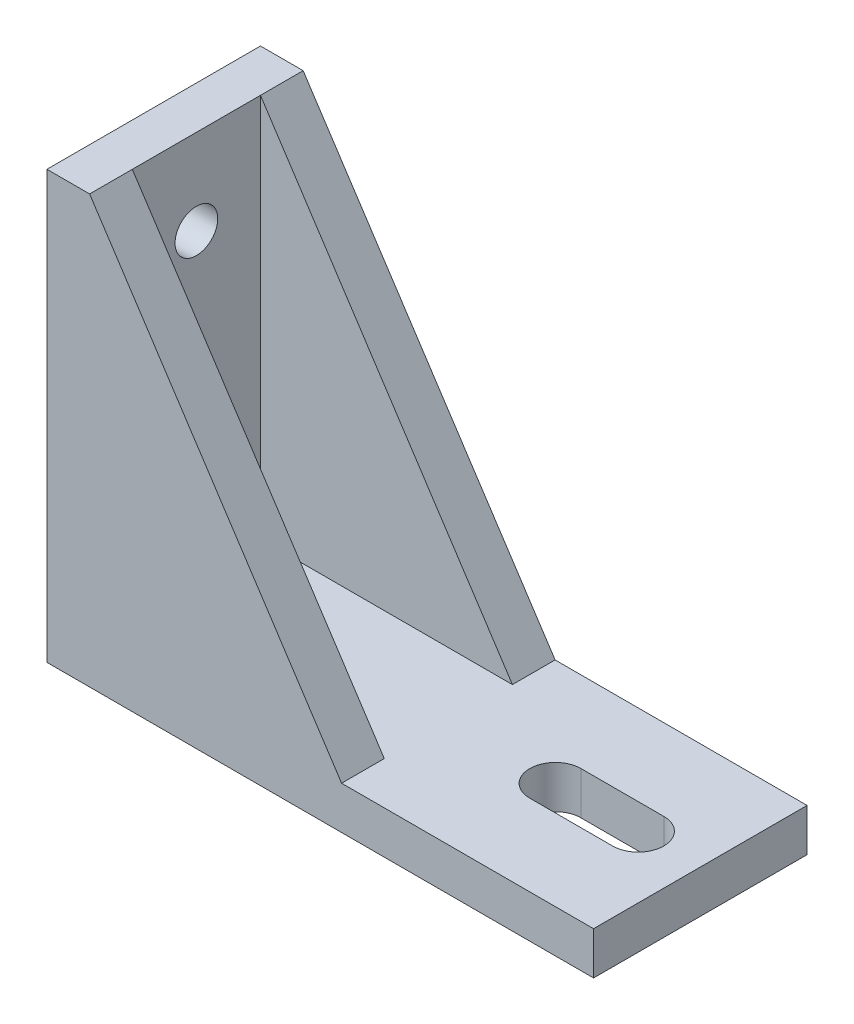
ISO-10303-21;
HEADER;
FILE_DESCRIPTION(('STEP AP214'),'2;1');
FILE_NAME('part.step','',(''),(''),'','','');
FILE_SCHEMA(('AUTOMOTIVE_DESIGN { 1 0 10303 214 1 1 1 1 }'));
ENDSEC;
DATA;
#1=APPLICATION_CONTEXT('core data for automotive mechanical design processes');
#2=APPLICATION_PROTOCOL_DEFINITION('international standard','automotive_design',2000,#1);
#3=PRODUCT_CONTEXT('',#1,'mechanical');
#4=PRODUCT('Part','Part','',(#3));
#5=PRODUCT_RELATED_PRODUCT_CATEGORY('part','',(#4));
#6=PRODUCT_DEFINITION_FORMATION('','',#4);
#7=PRODUCT_DEFINITION_CONTEXT('part definition',#1,'design');
#8=PRODUCT_DEFINITION('design','',#6,#7);
#9=PRODUCT_DEFINITION_SHAPE('','',#8);
#10=(LENGTH_UNIT() NAMED_UNIT(*) SI_UNIT(.MILLI.,.METRE.));
#11=(NAMED_UNIT(*) PLANE_ANGLE_UNIT() SI_UNIT($,.RADIAN.));
#12=(NAMED_UNIT(*) SI_UNIT($,.STERADIAN.) SOLID_ANGLE_UNIT());
#13=UNCERTAINTY_MEASURE_WITH_UNIT(LENGTH_MEASURE(1.E-05),#10,'distance_accuracy_value','');
#14=(GEOMETRIC_REPRESENTATION_CONTEXT(3) GLOBAL_UNCERTAINTY_ASSIGNED_CONTEXT((#13)) GLOBAL_UNIT_ASSIGNED_CONTEXT((#10,
#11,#12)) REPRESENTATION_CONTEXT('',''));
#15=CARTESIAN_POINT('',(0.,0.,0.));
#16=DIRECTION('',(0.,0.,1.));
#17=DIRECTION('',(1.,0.,0.));
#18=AXIS2_PLACEMENT_3D('',#15,#16,#17);
#19=CARTESIAN_POINT('',(-30.1722165221151,5.,-4.04636382411759));
#20=DIRECTION('',(1.,0.,0.));
#21=DIRECTION('',(0.,0.,-1.));
#22=AXIS2_PLACEMENT_3D('',#19,#20,#21);
#23=PLANE('',#22);
#24=CARTESIAN_POINT('',(-30.1722165221151,15.,3.4536361758824));
#25=DIRECTION('',(-1.,0.,0.));
#26=DIRECTION('',(0.,0.,1.));
#27=AXIS2_PLACEMENT_3D('',#24,#25,#26);
#28=CIRCLE('',#27,2.5);
#29=CARTESIAN_POINT('',(-30.1722165221151,15.,5.9536361758824));
#30=VERTEX_POINT('',#29);
#31=EDGE_CURVE('E303',#30,#30,#28,.T.);
#32=ORIENTED_EDGE('',*,*,#31,.F.);
#33=EDGE_LOOP('',(#32));
#34=FACE_BOUND('',#33,.T.);
#35=CARTESIAN_POINT('',(-30.1722165221151,40.,3.4536361758824));
#36=DIRECTION('',(-1.,0.,0.));
#37=DIRECTION('',(0.,0.,1.));
#38=AXIS2_PLACEMENT_3D('',#35,#36,#37);
#39=CIRCLE('',#38,2.5);
#40=CARTESIAN_POINT('',(-30.1722165221151,40.,5.95363617588241));
#41=VERTEX_POINT('',#40);
#42=EDGE_CURVE('E311',#41,#41,#39,.T.);
#43=ORIENTED_EDGE('',*,*,#42,.F.);
#44=EDGE_LOOP('',(#43));
#45=FACE_BOUND('',#44,.T.);
#46=DIRECTION('',(0.,0.,1.));
#47=VECTOR('',#46,1.);
#48=CARTESIAN_POINT('',(-30.1722165221151,0.,-4.04636382411759));
#49=LINE('',#48,#47);
#50=CARTESIAN_POINT('',(-30.1722165221151,0.,-9.04636382411759));
#51=VERTEX_POINT('',#50);
#52=CARTESIAN_POINT('',(-30.1722165221151,0.,15.9536361758824));
#53=VERTEX_POINT('',#52);
#54=EDGE_CURVE('E337',#51,#53,#49,.T.);
#55=ORIENTED_EDGE('',*,*,#54,.T.);
#56=DIRECTION('',(0.,-1.,0.));
#57=VECTOR('',#56,1.);
#58=CARTESIAN_POINT('',(-30.1722165221151,0.,15.9536361758824));
#59=LINE('',#58,#57);
#60=CARTESIAN_POINT('',(-30.1722165221151,50.,15.9536361758824));
#61=VERTEX_POINT('',#60);
#62=EDGE_CURVE('E253',#61,#53,#59,.T.);
#63=ORIENTED_EDGE('',*,*,#62,.F.);
#64=DIRECTION('',(0.,0.,1.));
#65=VECTOR('',#64,1.);
#66=CARTESIAN_POINT('',(-30.1722165221151,50.,-4.04636382411759));
#67=LINE('',#66,#65);
#68=CARTESIAN_POINT('',(-30.1722165221151,50.,-9.04636382411759));
#69=VERTEX_POINT('',#68);
#70=EDGE_CURVE('E320',#69,#61,#67,.T.);
#71=ORIENTED_EDGE('',*,*,#70,.F.);
#72=DIRECTION('',(0.,1.,0.));
#73=VECTOR('',#72,1.);
#74=CARTESIAN_POINT('',(-30.1722165221151,50.,-9.04636382411759));
#75=LINE('',#74,#73);
#76=EDGE_CURVE('E400',#51,#69,#75,.T.);
#77=ORIENTED_EDGE('',*,*,#76,.F.);
#78=EDGE_LOOP('',(#55,#63,#71,#77));
#79=FACE_BOUND('',#78,.T.);
#80=ADVANCED_FACE('F113',(#34,#45,#79),#23,.F.);
#81=CARTESIAN_POINT('',(33.8277834778849,5.,-4.04636382411759));
#82=DIRECTION('',(-1.,0.,0.));
#83=DIRECTION('',(0.,0.,1.));
#84=AXIS2_PLACEMENT_3D('',#81,#82,#83);
#85=PLANE('',#84);
#86=DIRECTION('',(0.,0.,-1.));
#87=VECTOR('',#86,1.);
#88=CARTESIAN_POINT('',(33.8277834778849,0.,-4.04636382411759));
#89=LINE('',#88,#87);
#90=CARTESIAN_POINT('',(33.8277834778849,0.,15.9536361758824));
#91=VERTEX_POINT('',#90);
#92=CARTESIAN_POINT('',(33.8277834778849,0.,-9.04636382411759));
#93=VERTEX_POINT('',#92);
#94=EDGE_CURVE('E342',#91,#93,#89,.T.);
#95=ORIENTED_EDGE('',*,*,#94,.T.);
#96=DIRECTION('',(0.,-1.,0.));
#97=VECTOR('',#96,1.);
#98=CARTESIAN_POINT('',(33.8277834778849,0.,-9.04636382411759));
#99=LINE('',#98,#97);
#100=CARTESIAN_POINT('',(33.8277834778849,5.,-9.04636382411759));
#101=VERTEX_POINT('',#100);
#102=EDGE_CURVE('E223',#101,#93,#99,.T.);
#103=ORIENTED_EDGE('',*,*,#102,.F.);
#104=DIRECTION('',(0.,0.,-1.));
#105=VECTOR('',#104,1.);
#106=CARTESIAN_POINT('',(33.8277834778849,5.,-4.04636382411759));
#107=LINE('',#106,#105);
#108=CARTESIAN_POINT('',(33.8277834778849,5.,15.9536361758824));
#109=VERTEX_POINT('',#108);
#110=EDGE_CURVE('E218',#109,#101,#107,.T.);
#111=ORIENTED_EDGE('',*,*,#110,.F.);
#112=DIRECTION('',(0.,1.,0.));
#113=VECTOR('',#112,1.);
#114=CARTESIAN_POINT('',(33.8277834778849,5.,15.9536361758824));
#115=LINE('',#114,#113);
#116=EDGE_CURVE('E261',#91,#109,#115,.T.);
#117=ORIENTED_EDGE('',*,*,#116,.F.);
#118=EDGE_LOOP('',(#95,#103,#111,#117));
#119=FACE_BOUND('',#118,.T.);
#120=ADVANCED_FACE('F388',(#119),#85,.F.);
#121=CARTESIAN_POINT('',(0.,5.,0.));
#122=DIRECTION('',(0.,1.,0.));
#123=DIRECTION('',(0.,0.,1.));
#124=AXIS2_PLACEMENT_3D('',#121,#122,#123);
#125=PLANE('',#124);
#126=CARTESIAN_POINT('',(26.5542372270442,5.,3.45370519441454));
#127=DIRECTION('',(0.,1.,0.));
#128=DIRECTION('',(0.,0.,1.));
#129=AXIS2_PLACEMENT_3D('',#126,#127,#128);
#130=CIRCLE('',#129,3.);
#131=CARTESIAN_POINT('',(26.55422092342,5.,6.45370519437026));
#132=VERTEX_POINT('',#131);
#133=CARTESIAN_POINT('',(26.5542535306684,5.,0.453705194458847));
#134=VERTEX_POINT('',#133);
#135=EDGE_CURVE('E128',#132,#134,#130,.T.);
#136=ORIENTED_EDGE('',*,*,#135,.F.);
#137=DIRECTION('',(0.999999999985233,0.,5.43454140294714E-06));
#138=VECTOR('',#137,1.);
#139=CARTESIAN_POINT('',(16.8542209235632,5.,6.45365247931865));
#140=LINE('',#139,#138);
#141=CARTESIAN_POINT('',(16.8542209235632,5.,6.45365247931863));
#142=VERTEX_POINT('',#141);
#143=EDGE_CURVE('E278',#142,#132,#140,.T.);
#144=ORIENTED_EDGE('',*,*,#143,.F.);
#145=CARTESIAN_POINT('',(16.8542372271874,5.,3.45365247936294));
#146=DIRECTION('',(0.,1.,0.));
#147=DIRECTION('',(0.,0.,1.));
#148=AXIS2_PLACEMENT_3D('',#145,#146,#147);
#149=CIRCLE('',#148,3.);
#150=CARTESIAN_POINT('',(16.8542535308116,5.,0.453652479407238));
#151=VERTEX_POINT('',#150);
#152=EDGE_CURVE('E285',#151,#142,#149,.T.);
#153=ORIENTED_EDGE('',*,*,#152,.F.);
#154=DIRECTION('',(0.999999999985233,0.,5.43454140294714E-06));
#155=VECTOR('',#154,1.);
#156=CARTESIAN_POINT('',(16.8542535308116,5.,0.453652479407238));
#157=LINE('',#156,#155);
#158=EDGE_CURVE('E281',#151,#134,#157,.T.);
#159=ORIENTED_EDGE('',*,*,#158,.T.);
#160=EDGE_LOOP('',(#136,#144,#153,#159));
#161=FACE_BOUND('',#160,.T.);
#162=DIRECTION('',(0.,0.,-1.));
#163=VECTOR('',#162,1.);
#164=CARTESIAN_POINT('',(-25.1722165221151,5.,-4.04636382411759));
#165=LINE('',#164,#163);
#166=CARTESIAN_POINT('',(-25.1722165221151,5.,10.9536361758824));
#167=VERTEX_POINT('',#166);
#168=CARTESIAN_POINT('',(-25.1722165221151,5.,-4.04636382411759));
#169=VERTEX_POINT('',#168);
#170=EDGE_CURVE('E319',#167,#169,#165,.T.);
#171=ORIENTED_EDGE('',*,*,#170,.F.);
#172=DIRECTION('',(1.,0.,0.));
#173=VECTOR('',#172,1.);
#174=CARTESIAN_POINT('',(-30.1722165221151,5.,10.9536361758824));
#175=LINE('',#174,#173);
#176=CARTESIAN_POINT('',(4.32778347788492,5.,10.9536361758824));
#177=VERTEX_POINT('',#176);
#178=EDGE_CURVE('E338',#167,#177,#175,.T.);
#179=ORIENTED_EDGE('',*,*,#178,.T.);
#180=DIRECTION('',(0.,0.,-1.));
#181=VECTOR('',#180,1.);
#182=CARTESIAN_POINT('',(4.32778347788492,5.,15.9536361758824));
#183=LINE('',#182,#181);
#184=CARTESIAN_POINT('',(4.32778347788492,5.,15.9536361758824));
#185=VERTEX_POINT('',#184);
#186=EDGE_CURVE('E275',#185,#177,#183,.T.);
#187=ORIENTED_EDGE('',*,*,#186,.F.);
#188=DIRECTION('',(-1.,0.,0.));
#189=VECTOR('',#188,1.);
#190=CARTESIAN_POINT('',(4.32778347788492,5.,15.9536361758824));
#191=LINE('',#190,#189);
#192=EDGE_CURVE('E265',#109,#185,#191,.T.);
#193=ORIENTED_EDGE('',*,*,#192,.F.);
#194=ORIENTED_EDGE('',*,*,#110,.T.);
#195=DIRECTION('',(1.,0.,0.));
#196=VECTOR('',#195,1.);
#197=CARTESIAN_POINT('',(33.8277834778849,5.,-9.04636382411759));
#198=LINE('',#197,#196);
#199=CARTESIAN_POINT('',(4.32778347788492,5.,-9.04636382411759));
#200=VERTEX_POINT('',#199);
#201=EDGE_CURVE('E209',#200,#101,#198,.T.);
#202=ORIENTED_EDGE('',*,*,#201,.F.);
#203=DIRECTION('',(0.,0.,1.));
#204=VECTOR('',#203,1.);
#205=CARTESIAN_POINT('',(4.32778347788492,5.,-9.04636382411759));
#206=LINE('',#205,#204);
#207=CARTESIAN_POINT('',(4.32778347788492,5.,-4.04636382411759));
#208=VERTEX_POINT('',#207);
#209=EDGE_CURVE('E215',#200,#208,#206,.T.);
#210=ORIENTED_EDGE('',*,*,#209,.T.);
#211=DIRECTION('',(-1.,0.,0.));
#212=VECTOR('',#211,1.);
#213=CARTESIAN_POINT('',(-30.1722165221151,5.,-4.04636382411759));
#214=LINE('',#213,#212);
#215=EDGE_CURVE('E345',#208,#169,#214,.T.);
#216=ORIENTED_EDGE('',*,*,#215,.T.);
#217=EDGE_LOOP('',(#171,#179,#187,#193,#194,#202,#210,#216));
#218=FACE_BOUND('',#217,.T.);
#219=ADVANCED_FACE('F212',(#161,#218),#125,.T.);
#220=CARTESIAN_POINT('',(0.,0.,0.));
#221=DIRECTION('',(0.,1.,0.));
#222=DIRECTION('',(0.,0.,1.));
#223=AXIS2_PLACEMENT_3D('',#220,#221,#222);
#224=PLANE('',#223);
#225=CARTESIAN_POINT('',(26.5542372270442,0.,3.45370519441454));
#226=DIRECTION('',(0.,1.,0.));
#227=DIRECTION('',(0.,0.,1.));
#228=AXIS2_PLACEMENT_3D('',#225,#226,#227);
#229=CIRCLE('',#228,3.);
#230=CARTESIAN_POINT('',(26.55422092342,0.,6.45370519437024));
#231=VERTEX_POINT('',#230);
#232=CARTESIAN_POINT('',(26.5542535306684,0.,0.453705194458847));
#233=VERTEX_POINT('',#232);
#234=EDGE_CURVE('E121',#231,#233,#229,.T.);
#235=ORIENTED_EDGE('',*,*,#234,.T.);
#236=DIRECTION('',(-0.999999999985233,0.,-5.43454140294714E-06));
#237=VECTOR('',#236,1.);
#238=CARTESIAN_POINT('',(-2.46489540427867E-06,0.,0.453560884255213));
#239=LINE('',#238,#237);
#240=CARTESIAN_POINT('',(16.8542535308116,0.,0.453652479407238));
#241=VERTEX_POINT('',#240);
#242=EDGE_CURVE('E13',#233,#241,#239,.T.);
#243=ORIENTED_EDGE('',*,*,#242,.T.);
#244=CARTESIAN_POINT('',(16.8542372271874,0.,3.45365247936294));
#245=DIRECTION('',(0.,1.,0.));
#246=DIRECTION('',(0.,0.,1.));
#247=AXIS2_PLACEMENT_3D('',#244,#245,#246);
#248=CIRCLE('',#247,3.);
#249=CARTESIAN_POINT('',(16.8542209235632,0.,6.45365247931863));
#250=VERTEX_POINT('',#249);
#251=EDGE_CURVE('E356',#241,#250,#248,.T.);
#252=ORIENTED_EDGE('',*,*,#251,.T.);
#253=DIRECTION('',(0.999999999985233,0.,5.43454140294714E-06));
#254=VECTOR('',#253,1.);
#255=CARTESIAN_POINT('',(-3.50721438219615E-05,0.,6.45356088416661));
#256=LINE('',#255,#254);
#257=EDGE_CURVE('E348',#250,#231,#256,.T.);
#258=ORIENTED_EDGE('',*,*,#257,.T.);
#259=EDGE_LOOP('',(#235,#243,#252,#258));
#260=FACE_BOUND('',#259,.T.);
#261=ORIENTED_EDGE('',*,*,#54,.F.);
#262=DIRECTION('',(-1.,0.,0.));
#263=VECTOR('',#262,1.);
#264=CARTESIAN_POINT('',(-30.1722165221151,0.,-9.04636382411759));
#265=LINE('',#264,#263);
#266=EDGE_CURVE('E408',#93,#51,#265,.T.);
#267=ORIENTED_EDGE('',*,*,#266,.F.);
#268=ORIENTED_EDGE('',*,*,#94,.F.);
#269=DIRECTION('',(1.,0.,0.));
#270=VECTOR('',#269,1.);
#271=CARTESIAN_POINT('',(33.8277834778849,0.,15.9536361758824));
#272=LINE('',#271,#270);
#273=EDGE_CURVE('E257',#53,#91,#272,.T.);
#274=ORIENTED_EDGE('',*,*,#273,.F.);
#275=EDGE_LOOP('',(#261,#267,#268,#274));
#276=FACE_BOUND('',#275,.T.);
#277=ADVANCED_FACE('F362',(#260,#276),#224,.F.);
#278=CARTESIAN_POINT('',(-25.1722165221151,50.,-4.04636382411759));
#279=DIRECTION('',(-1.,0.,0.));
#280=DIRECTION('',(0.,0.,1.));
#281=AXIS2_PLACEMENT_3D('',#278,#279,#280);
#282=PLANE('',#281);
#283=CARTESIAN_POINT('',(-25.1722165221151,15.,3.4536361758824));
#284=DIRECTION('',(-1.,0.,0.));
#285=DIRECTION('',(0.,0.,1.));
#286=AXIS2_PLACEMENT_3D('',#283,#284,#285);
#287=CIRCLE('',#286,2.5);
#288=CARTESIAN_POINT('',(-25.1722165221151,15.,5.9536361758824));
#289=VERTEX_POINT('',#288);
#290=EDGE_CURVE('E307',#289,#289,#287,.T.);
#291=ORIENTED_EDGE('',*,*,#290,.T.);
#292=EDGE_LOOP('',(#291));
#293=FACE_BOUND('',#292,.T.);
#294=CARTESIAN_POINT('',(-25.1722165221151,40.,3.4536361758824));
#295=DIRECTION('',(-1.,0.,0.));
#296=DIRECTION('',(0.,0.,1.));
#297=AXIS2_PLACEMENT_3D('',#294,#295,#296);
#298=CIRCLE('',#297,2.5);
#299=CARTESIAN_POINT('',(-25.1722165221151,40.,5.95363617588241));
#300=VERTEX_POINT('',#299);
#301=EDGE_CURVE('E315',#300,#300,#298,.T.);
#302=ORIENTED_EDGE('',*,*,#301,.T.);
#303=EDGE_LOOP('',(#302));
#304=FACE_BOUND('',#303,.T.);
#305=ORIENTED_EDGE('',*,*,#170,.T.);
#306=DIRECTION('',(0.,-1.,0.));
#307=VECTOR('',#306,1.);
#308=CARTESIAN_POINT('',(-25.1722165221151,50.,-4.04636382411759));
#309=LINE('',#308,#307);
#310=CARTESIAN_POINT('',(-25.1722165221151,50.,-4.04636382411759));
#311=VERTEX_POINT('',#310);
#312=EDGE_CURVE('E327',#311,#169,#309,.T.);
#313=ORIENTED_EDGE('',*,*,#312,.F.);
#314=DIRECTION('',(0.,0.,-1.));
#315=VECTOR('',#314,1.);
#316=CARTESIAN_POINT('',(-25.1722165221151,50.,-4.04636382411759));
#317=LINE('',#316,#315);
#318=CARTESIAN_POINT('',(-25.1722165221151,50.,10.9536361758824));
#319=VERTEX_POINT('',#318);
#320=EDGE_CURVE('E323',#319,#311,#317,.T.);
#321=ORIENTED_EDGE('',*,*,#320,.F.);
#322=DIRECTION('',(0.,-1.,0.));
#323=VECTOR('',#322,1.);
#324=CARTESIAN_POINT('',(-25.1722165221151,50.,10.9536361758824));
#325=LINE('',#324,#323);
#326=EDGE_CURVE('E333',#319,#167,#325,.T.);
#327=ORIENTED_EDGE('',*,*,#326,.T.);
#328=EDGE_LOOP('',(#305,#313,#321,#327));
#329=FACE_BOUND('',#328,.T.);
#330=ADVANCED_FACE('F425',(#293,#304,#329),#282,.F.);
#331=CARTESIAN_POINT('',(0.,50.,0.));
#332=DIRECTION('',(0.,1.,0.));
#333=DIRECTION('',(0.,0.,1.));
#334=AXIS2_PLACEMENT_3D('',#331,#332,#333);
#335=PLANE('',#334);
#336=ORIENTED_EDGE('',*,*,#70,.T.);
#337=DIRECTION('',(-1.,0.,0.));
#338=VECTOR('',#337,1.);
#339=CARTESIAN_POINT('',(-30.1722165221151,50.,15.9536361758824));
#340=LINE('',#339,#338);
#341=CARTESIAN_POINT('',(-25.1722165221151,50.,15.9536361758824));
#342=VERTEX_POINT('',#341);
#343=EDGE_CURVE('E245',#342,#61,#340,.T.);
#344=ORIENTED_EDGE('',*,*,#343,.F.);
#345=DIRECTION('',(0.,0.,-1.));
#346=VECTOR('',#345,1.);
#347=CARTESIAN_POINT('',(-25.1722165221151,50.,15.9536361758824));
#348=LINE('',#347,#346);
#349=EDGE_CURVE('E270',#342,#319,#348,.T.);
#350=ORIENTED_EDGE('',*,*,#349,.T.);
#351=ORIENTED_EDGE('',*,*,#320,.T.);
#352=DIRECTION('',(0.,0.,1.));
#353=VECTOR('',#352,1.);
#354=CARTESIAN_POINT('',(-25.1722165221151,50.,-9.04636382411759));
#355=LINE('',#354,#353);
#356=CARTESIAN_POINT('',(-25.1722165221151,50.,-9.04636382411759));
#357=VERTEX_POINT('',#356);
#358=EDGE_CURVE('E240',#357,#311,#355,.T.);
#359=ORIENTED_EDGE('',*,*,#358,.F.);
#360=DIRECTION('',(1.,0.,0.));
#361=VECTOR('',#360,1.);
#362=CARTESIAN_POINT('',(-25.1722165221151,50.,-9.04636382411759));
#363=LINE('',#362,#361);
#364=EDGE_CURVE('E230',#69,#357,#363,.T.);
#365=ORIENTED_EDGE('',*,*,#364,.F.);
#366=EDGE_LOOP('',(#336,#344,#350,#351,#359,#365));
#367=FACE_BOUND('',#366,.T.);
#368=ADVANCED_FACE('F419',(#367),#335,.T.);
#369=CARTESIAN_POINT('',(-30.1722165221151,40.,3.4536361758824));
#370=DIRECTION('',(-1.,0.,0.));
#371=DIRECTION('',(0.,0.,1.));
#372=AXIS2_PLACEMENT_3D('',#369,#370,#371);
#373=CYLINDRICAL_SURFACE('',#372,2.5);
#374=ORIENTED_EDGE('',*,*,#301,.F.);
#375=EDGE_LOOP('',(#374));
#376=FACE_BOUND('',#375,.T.);
#377=ORIENTED_EDGE('',*,*,#42,.T.);
#378=EDGE_LOOP('',(#377));
#379=FACE_BOUND('',#378,.T.);
#380=ADVANCED_FACE('F467',(#376,#379),#373,.F.);
#381=CARTESIAN_POINT('',(-30.1722165221151,15.,3.4536361758824));
#382=DIRECTION('',(-1.,0.,0.));
#383=DIRECTION('',(0.,0.,1.));
#384=AXIS2_PLACEMENT_3D('',#381,#382,#383);
#385=CYLINDRICAL_SURFACE('',#384,2.5);
#386=ORIENTED_EDGE('',*,*,#290,.F.);
#387=EDGE_LOOP('',(#386));
#388=FACE_BOUND('',#387,.T.);
#389=ORIENTED_EDGE('',*,*,#31,.T.);
#390=EDGE_LOOP('',(#389));
#391=FACE_BOUND('',#390,.T.);
#392=ADVANCED_FACE('F550',(#388,#391),#385,.F.);
#393=CARTESIAN_POINT('',(26.5542372270442,5.,3.45370519441454));
#394=DIRECTION('',(0.,1.,0.));
#395=DIRECTION('',(0.,0.,1.));
#396=AXIS2_PLACEMENT_3D('',#393,#394,#395);
#397=CYLINDRICAL_SURFACE('',#396,3.);
#398=DIRECTION('',(0.,1.,0.));
#399=VECTOR('',#398,1.);
#400=CARTESIAN_POINT('',(26.55422092342,5.,6.45370519437024));
#401=LINE('',#400,#399);
#402=EDGE_CURVE('E135',#132,#231,#401,.F.);
#403=ORIENTED_EDGE('',*,*,#402,.F.);
#404=ORIENTED_EDGE('',*,*,#135,.T.);
#405=DIRECTION('',(0.,1.,0.));
#406=VECTOR('',#405,1.);
#407=CARTESIAN_POINT('',(26.5542535306684,5.,0.453705194458847));
#408=LINE('',#407,#406);
#409=EDGE_CURVE('E298',#233,#134,#408,.T.);
#410=ORIENTED_EDGE('',*,*,#409,.F.);
#411=ORIENTED_EDGE('',*,*,#234,.F.);
#412=EDGE_LOOP('',(#403,#404,#410,#411));
#413=FACE_BOUND('',#412,.T.);
#414=ADVANCED_FACE('F364',(#413),#397,.F.);
#415=CARTESIAN_POINT('',(16.8542372271874,5.,3.45365247936294));
#416=DIRECTION('',(0.,1.,0.));
#417=DIRECTION('',(0.,0.,1.));
#418=AXIS2_PLACEMENT_3D('',#415,#416,#417);
#419=CYLINDRICAL_SURFACE('',#418,3.);
#420=DIRECTION('',(0.,1.,0.));
#421=VECTOR('',#420,1.);
#422=CARTESIAN_POINT('',(16.8542535308116,5.,0.453652479407238));
#423=LINE('',#422,#421);
#424=EDGE_CURVE('E292',#151,#241,#423,.F.);
#425=ORIENTED_EDGE('',*,*,#424,.F.);
#426=ORIENTED_EDGE('',*,*,#152,.T.);
#427=DIRECTION('',(0.,1.,0.));
#428=VECTOR('',#427,1.);
#429=CARTESIAN_POINT('',(16.8542209235632,5.,6.45365247931863));
#430=LINE('',#429,#428);
#431=EDGE_CURVE('E289',#250,#142,#430,.T.);
#432=ORIENTED_EDGE('',*,*,#431,.F.);
#433=ORIENTED_EDGE('',*,*,#251,.F.);
#434=EDGE_LOOP('',(#425,#426,#432,#433));
#435=FACE_BOUND('',#434,.T.);
#436=ADVANCED_FACE('F373',(#435),#419,.F.);
#437=CARTESIAN_POINT('',(16.8542535308116,5.,0.453652479407238));
#438=DIRECTION('',(5.43454140294714E-06,0.,-0.999999999985233));
#439=DIRECTION('',(-0.999999999985233,0.,-5.43454140294714E-06));
#440=AXIS2_PLACEMENT_3D('',#437,#438,#439);
#441=PLANE('',#440);
#442=ORIENTED_EDGE('',*,*,#409,.T.);
#443=ORIENTED_EDGE('',*,*,#158,.F.);
#444=ORIENTED_EDGE('',*,*,#424,.T.);
#445=ORIENTED_EDGE('',*,*,#242,.F.);
#446=EDGE_LOOP('',(#442,#443,#444,#445));
#447=FACE_BOUND('',#446,.T.);
#448=ADVANCED_FACE('F366',(#447),#441,.F.);
#449=CARTESIAN_POINT('',(16.8542209235632,5.,6.45365247931863));
#450=DIRECTION('',(-5.43454140294714E-06,0.,0.999999999985233));
#451=DIRECTION('',(0.999999999985233,0.,5.43454140294714E-06));
#452=AXIS2_PLACEMENT_3D('',#449,#450,#451);
#453=PLANE('',#452);
#454=ORIENTED_EDGE('',*,*,#431,.T.);
#455=ORIENTED_EDGE('',*,*,#143,.T.);
#456=ORIENTED_EDGE('',*,*,#402,.T.);
#457=ORIENTED_EDGE('',*,*,#257,.F.);
#458=EDGE_LOOP('',(#454,#455,#456,#457));
#459=FACE_BOUND('',#458,.T.);
#460=ADVANCED_FACE('F374',(#459),#453,.F.);
#461=CARTESIAN_POINT('',(0.,0.,10.9536361758824));
#462=DIRECTION('',(0.,0.,-1.));
#463=DIRECTION('',(-1.,0.,0.));
#464=AXIS2_PLACEMENT_3D('',#461,#462,#463);
#465=PLANE('',#464);
#466=ORIENTED_EDGE('',*,*,#178,.F.);
#467=ORIENTED_EDGE('',*,*,#326,.F.);
#468=DIRECTION('',(-0.548250429826891,0.836314214990173,0.));
#469=VECTOR('',#468,1.);
#470=CARTESIAN_POINT('',(-25.1722165221151,50.,10.9536361758824));
#471=LINE('',#470,#469);
#472=EDGE_CURVE('E239',#177,#319,#471,.T.);
#473=ORIENTED_EDGE('',*,*,#472,.F.);
#474=EDGE_LOOP('',(#466,#467,#473));
#475=FACE_BOUND('',#474,.T.);
#476=ADVANCED_FACE('F376',(#475),#465,.T.);
#477=CARTESIAN_POINT('',(-25.1722165221151,50.,15.9536361758824));
#478=DIRECTION('',(-0.836314214990173,-0.548250429826891,0.));
#479=DIRECTION('',(0.548250429826891,-0.836314214990173,0.));
#480=AXIS2_PLACEMENT_3D('',#477,#478,#479);
#481=PLANE('',#480);
#482=ORIENTED_EDGE('',*,*,#472,.T.);
#483=ORIENTED_EDGE('',*,*,#349,.F.);
#484=DIRECTION('',(-0.548250429826891,0.836314214990173,0.));
#485=VECTOR('',#484,1.);
#486=CARTESIAN_POINT('',(-25.1722165221151,50.,15.9536361758824));
#487=LINE('',#486,#485);
#488=EDGE_CURVE('E268',#185,#342,#487,.T.);
#489=ORIENTED_EDGE('',*,*,#488,.F.);
#490=ORIENTED_EDGE('',*,*,#186,.T.);
#491=EDGE_LOOP('',(#482,#483,#489,#490));
#492=FACE_BOUND('',#491,.T.);
#493=ADVANCED_FACE('F382',(#492),#481,.F.);
#494=CARTESIAN_POINT('',(0.,0.,15.9536361758824));
#495=DIRECTION('',(0.,0.,-1.));
#496=DIRECTION('',(-1.,0.,0.));
#497=AXIS2_PLACEMENT_3D('',#494,#495,#496);
#498=PLANE('',#497);
#499=ORIENTED_EDGE('',*,*,#343,.T.);
#500=ORIENTED_EDGE('',*,*,#62,.T.);
#501=ORIENTED_EDGE('',*,*,#273,.T.);
#502=ORIENTED_EDGE('',*,*,#116,.T.);
#503=ORIENTED_EDGE('',*,*,#192,.T.);
#504=ORIENTED_EDGE('',*,*,#488,.T.);
#505=EDGE_LOOP('',(#499,#500,#501,#502,#503,#504));
#506=FACE_BOUND('',#505,.T.);
#507=ADVANCED_FACE('F405',(#506),#498,.F.);
#508=CARTESIAN_POINT('',(4.32778347788492,5.,-9.04636382411759));
#509=DIRECTION('',(-0.836314214990173,-0.548250429826891,0.));
#510=DIRECTION('',(0.548250429826891,-0.836314214990173,0.));
#511=AXIS2_PLACEMENT_3D('',#508,#509,#510);
#512=PLANE('',#511);
#513=DIRECTION('',(0.548250429826891,-0.836314214990173,0.));
#514=VECTOR('',#513,1.);
#515=CARTESIAN_POINT('',(4.32778347788492,5.,-4.04636382411759));
#516=LINE('',#515,#514);
#517=EDGE_CURVE('E234',#311,#208,#516,.T.);
#518=ORIENTED_EDGE('',*,*,#517,.T.);
#519=ORIENTED_EDGE('',*,*,#209,.F.);
#520=DIRECTION('',(0.548250429826891,-0.836314214990173,0.));
#521=VECTOR('',#520,1.);
#522=CARTESIAN_POINT('',(4.32778347788492,5.,-9.04636382411759));
#523=LINE('',#522,#521);
#524=EDGE_CURVE('E224',#357,#200,#523,.T.);
#525=ORIENTED_EDGE('',*,*,#524,.F.);
#526=ORIENTED_EDGE('',*,*,#358,.T.);
#527=EDGE_LOOP('',(#518,#519,#525,#526));
#528=FACE_BOUND('',#527,.T.);
#529=ADVANCED_FACE('F236',(#528),#512,.F.);
#530=CARTESIAN_POINT('',(0.,0.,-9.04636382411759));
#531=DIRECTION('',(0.,0.,1.));
#532=DIRECTION('',(1.,0.,0.));
#533=AXIS2_PLACEMENT_3D('',#530,#531,#532);
#534=PLANE('',#533);
#535=ORIENTED_EDGE('',*,*,#524,.T.);
#536=ORIENTED_EDGE('',*,*,#201,.T.);
#537=ORIENTED_EDGE('',*,*,#102,.T.);
#538=ORIENTED_EDGE('',*,*,#266,.T.);
#539=ORIENTED_EDGE('',*,*,#76,.T.);
#540=ORIENTED_EDGE('',*,*,#364,.T.);
#541=EDGE_LOOP('',(#535,#536,#537,#538,#539,#540));
#542=FACE_BOUND('',#541,.T.);
#543=ADVANCED_FACE('F227',(#542),#534,.F.);
#544=CARTESIAN_POINT('',(0.,0.,-4.04636382411759));
#545=DIRECTION('',(0.,0.,1.));
#546=DIRECTION('',(1.,0.,0.));
#547=AXIS2_PLACEMENT_3D('',#544,#545,#546);
#548=PLANE('',#547);
#549=ORIENTED_EDGE('',*,*,#517,.F.);
#550=ORIENTED_EDGE('',*,*,#312,.T.);
#551=ORIENTED_EDGE('',*,*,#215,.F.);
#552=EDGE_LOOP('',(#549,#550,#551));
#553=FACE_BOUND('',#552,.T.);
#554=ADVANCED_FACE('F423',(#553),#548,.T.);
#555=CLOSED_SHELL('',(#80,#120,#219,#277,#330,#368,#380,#392,#414,#436,#448,#460,#476,#493,#507,
#529,#543,#554));
#556=MANIFOLD_SOLID_BREP('B2',#555);
#557=ADVANCED_BREP_SHAPE_REPRESENTATION('',(#18,#556),#14);
#558=SHAPE_DEFINITION_REPRESENTATION(#9,#557);
ENDSEC;
END-ISO-10303-21;
